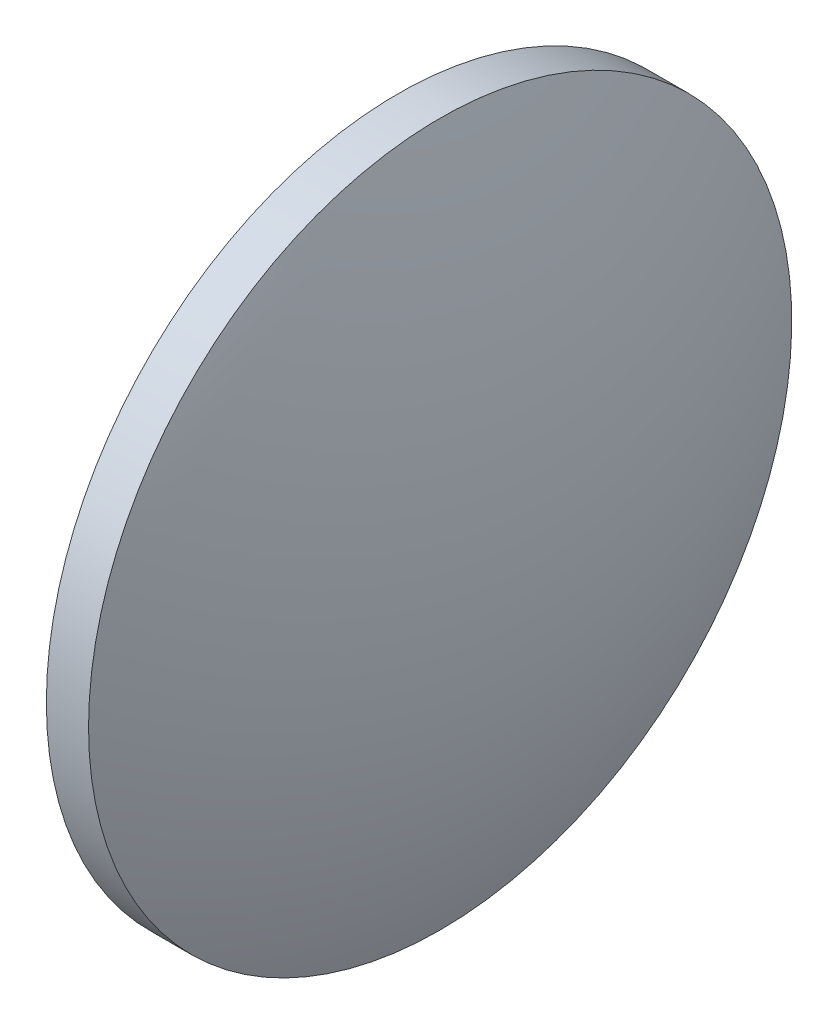
ISO-10303-21;
HEADER;
FILE_DESCRIPTION(('STEP AP214'),'2;1');
FILE_NAME('part.step','',(''),(''),'','','');
FILE_SCHEMA(('AUTOMOTIVE_DESIGN { 1 0 10303 214 1 1 1 1 }'));
ENDSEC;
DATA;
#1=APPLICATION_CONTEXT('core data for automotive mechanical design processes');
#2=APPLICATION_PROTOCOL_DEFINITION('international standard','automotive_design',2000,#1);
#3=PRODUCT_CONTEXT('',#1,'mechanical');
#4=PRODUCT('Part','Part','',(#3));
#5=PRODUCT_RELATED_PRODUCT_CATEGORY('part','',(#4));
#6=PRODUCT_DEFINITION_FORMATION('','',#4);
#7=PRODUCT_DEFINITION_CONTEXT('part definition',#1,'design');
#8=PRODUCT_DEFINITION('design','',#6,#7);
#9=PRODUCT_DEFINITION_SHAPE('','',#8);
#10=(LENGTH_UNIT() NAMED_UNIT(*) SI_UNIT(.MILLI.,.METRE.));
#11=(NAMED_UNIT(*) PLANE_ANGLE_UNIT() SI_UNIT($,.RADIAN.));
#12=(NAMED_UNIT(*) SI_UNIT($,.STERADIAN.) SOLID_ANGLE_UNIT());
#13=UNCERTAINTY_MEASURE_WITH_UNIT(LENGTH_MEASURE(1.E-05),#10,'distance_accuracy_value','');
#14=(GEOMETRIC_REPRESENTATION_CONTEXT(3) GLOBAL_UNCERTAINTY_ASSIGNED_CONTEXT((#13)) GLOBAL_UNIT_ASSIGNED_CONTEXT((#10,
#11,#12)) REPRESENTATION_CONTEXT('',''));
#15=CARTESIAN_POINT('',(0.,0.,0.));
#16=DIRECTION('',(0.,0.,1.));
#17=DIRECTION('',(1.,0.,0.));
#18=AXIS2_PLACEMENT_3D('',#15,#16,#17);
#19=CARTESIAN_POINT('',(562.257854945979,196.702283008934,0.));
#20=DIRECTION('',(-1.,0.,0.));
#21=DIRECTION('',(0.,-1.,0.));
#22=AXIS2_PLACEMENT_3D('',#19,#20,#21);
#23=SPHERICAL_SURFACE('',#22,32.5);
#24=CARTESIAN_POINT('',(592.257854945979,196.702283008934,0.));
#25=DIRECTION('',(-1.,0.,0.));
#26=DIRECTION('',(0.,0.,1.));
#27=AXIS2_PLACEMENT_3D('',#24,#25,#26);
#28=CIRCLE('',#27,12.5);
#29=CARTESIAN_POINT('',(592.257854945979,196.702283008934,12.5));
#30=VERTEX_POINT('',#29);
#31=EDGE_CURVE('E10',#30,#30,#28,.T.);
#32=ORIENTED_EDGE('',*,*,#31,.F.);
#33=EDGE_LOOP('',(#32));
#34=FACE_BOUND('',#33,.T.);
#35=ADVANCED_FACE('F35',(#34),#23,.T.);
#36=CARTESIAN_POINT('',(588.392239043218,196.702283008934,0.));
#37=DIRECTION('',(-1.,0.,0.));
#38=DIRECTION('',(0.,0.,1.));
#39=AXIS2_PLACEMENT_3D('',#36,#37,#38);
#40=CYLINDRICAL_SURFACE('',#39,12.5);
#41=CARTESIAN_POINT('',(590.757854945979,196.702283008934,0.));
#42=DIRECTION('',(-1.,0.,0.));
#43=DIRECTION('',(0.,0.,1.));
#44=AXIS2_PLACEMENT_3D('',#41,#42,#43);
#45=CIRCLE('',#44,12.5);
#46=CARTESIAN_POINT('',(590.757854945979,196.702283008934,12.5));
#47=VERTEX_POINT('',#46);
#48=EDGE_CURVE('E41',#47,#47,#45,.T.);
#49=ORIENTED_EDGE('',*,*,#48,.F.);
#50=EDGE_LOOP('',(#49));
#51=FACE_BOUND('',#50,.T.);
#52=ORIENTED_EDGE('',*,*,#31,.T.);
#53=EDGE_LOOP('',(#52));
#54=FACE_BOUND('',#53,.T.);
#55=ADVANCED_FACE('F49',(#51,#54),#40,.T.);
#56=CARTESIAN_POINT('',(590.757854945979,196.702283008934,0.));
#57=DIRECTION('',(1.,0.,0.));
#58=DIRECTION('',(0.,0.,-1.));
#59=AXIS2_PLACEMENT_3D('',#56,#57,#58);
#60=PLANE('',#59);
#61=ORIENTED_EDGE('',*,*,#48,.T.);
#62=EDGE_LOOP('',(#61));
#63=FACE_BOUND('',#62,.T.);
#64=ADVANCED_FACE('F47',(#63),#60,.F.);
#65=CLOSED_SHELL('',(#35,#55,#64));
#66=MANIFOLD_SOLID_BREP('B2',#65);
#67=ADVANCED_BREP_SHAPE_REPRESENTATION('',(#18,#66),#14);
#68=SHAPE_DEFINITION_REPRESENTATION(#9,#67);
ENDSEC;
END-ISO-10303-21;
